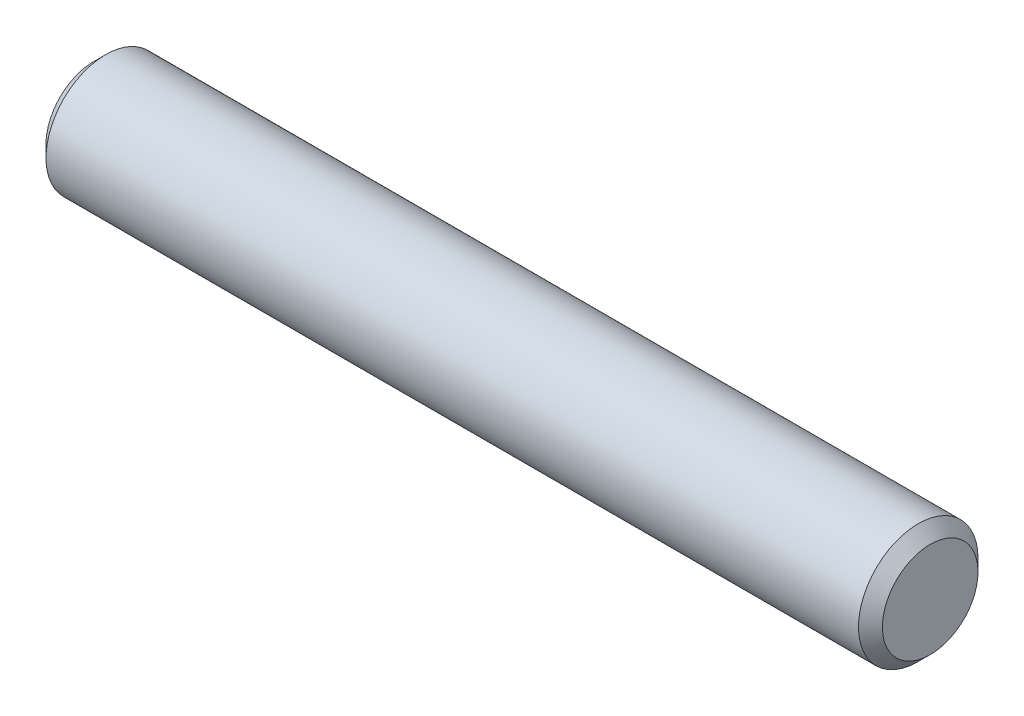
ISO-10303-21;
HEADER;
FILE_DESCRIPTION(('STEP AP214'),'2;1');
FILE_NAME('part.step','',(''),(''),'','','');
FILE_SCHEMA(('AUTOMOTIVE_DESIGN { 1 0 10303 214 1 1 1 1 }'));
ENDSEC;
DATA;
#1=APPLICATION_CONTEXT('core data for automotive mechanical design processes');
#2=APPLICATION_PROTOCOL_DEFINITION('international standard','automotive_design',2000,#1);
#3=PRODUCT_CONTEXT('',#1,'mechanical');
#4=PRODUCT('Part','Part','',(#3));
#5=PRODUCT_RELATED_PRODUCT_CATEGORY('part','',(#4));
#6=PRODUCT_DEFINITION_FORMATION('','',#4);
#7=PRODUCT_DEFINITION_CONTEXT('part definition',#1,'design');
#8=PRODUCT_DEFINITION('design','',#6,#7);
#9=PRODUCT_DEFINITION_SHAPE('','',#8);
#10=(LENGTH_UNIT() NAMED_UNIT(*) SI_UNIT(.MILLI.,.METRE.));
#11=(NAMED_UNIT(*) PLANE_ANGLE_UNIT() SI_UNIT($,.RADIAN.));
#12=(NAMED_UNIT(*) SI_UNIT($,.STERADIAN.) SOLID_ANGLE_UNIT());
#13=UNCERTAINTY_MEASURE_WITH_UNIT(LENGTH_MEASURE(1.E-05),#10,'distance_accuracy_value','');
#14=(GEOMETRIC_REPRESENTATION_CONTEXT(3) GLOBAL_UNCERTAINTY_ASSIGNED_CONTEXT((#13)) GLOBAL_UNIT_ASSIGNED_CONTEXT((#10,
#11,#12)) REPRESENTATION_CONTEXT('',''));
#15=CARTESIAN_POINT('',(0.,0.,0.));
#16=DIRECTION('',(0.,0.,1.));
#17=DIRECTION('',(1.,0.,0.));
#18=AXIS2_PLACEMENT_3D('',#15,#16,#17);
#19=CARTESIAN_POINT('',(-11.1125,0.,0.));
#20=DIRECTION('',(1.,0.,0.));
#21=DIRECTION('',(0.,0.,-1.));
#22=AXIS2_PLACEMENT_3D('',#19,#20,#21);
#23=CYLINDRICAL_SURFACE('',#22,1.5875);
#24=CARTESIAN_POINT('',(10.795,0.,0.));
#25=DIRECTION('',(1.,0.,0.));
#26=DIRECTION('',(0.,0.,-1.));
#27=AXIS2_PLACEMENT_3D('',#24,#25,#26);
#28=CIRCLE('',#27,1.5875);
#29=CARTESIAN_POINT('',(10.795,0.,-1.5875));
#30=VERTEX_POINT('',#29);
#31=EDGE_CURVE('E39',#30,#30,#28,.F.);
#32=ORIENTED_EDGE('',*,*,#31,.T.);
#33=EDGE_LOOP('',(#32));
#34=FACE_BOUND('',#33,.T.);
#35=CARTESIAN_POINT('',(-10.795,0.,0.));
#36=DIRECTION('',(1.,0.,0.));
#37=DIRECTION('',(0.,0.,-1.));
#38=AXIS2_PLACEMENT_3D('',#35,#36,#37);
#39=CIRCLE('',#38,1.5875);
#40=CARTESIAN_POINT('',(-10.795,0.,-1.5875));
#41=VERTEX_POINT('',#40);
#42=EDGE_CURVE('E43',#41,#41,#39,.T.);
#43=ORIENTED_EDGE('',*,*,#42,.T.);
#44=EDGE_LOOP('',(#43));
#45=FACE_BOUND('',#44,.T.);
#46=ADVANCED_FACE('F32',(#34,#45),#23,.T.);
#47=CARTESIAN_POINT('',(-11.1125,0.,0.));
#48=DIRECTION('',(1.,0.,0.));
#49=DIRECTION('',(0.,0.,-1.));
#50=AXIS2_PLACEMENT_3D('',#47,#48,#49);
#51=PLANE('',#50);
#52=CARTESIAN_POINT('',(-11.1125,0.,0.));
#53=DIRECTION('',(1.,0.,0.));
#54=DIRECTION('',(0.,0.,-1.));
#55=AXIS2_PLACEMENT_3D('',#52,#53,#54);
#56=CIRCLE('',#55,1.26999999999999);
#57=CARTESIAN_POINT('',(-11.1125,0.,-1.26999999999999));
#58=VERTEX_POINT('',#57);
#59=EDGE_CURVE('E10',#58,#58,#56,.F.);
#60=ORIENTED_EDGE('',*,*,#59,.T.);
#61=EDGE_LOOP('',(#60));
#62=FACE_BOUND('',#61,.T.);
#63=ADVANCED_FACE('F63',(#62),#51,.F.);
#64=CARTESIAN_POINT('',(11.1125,0.,0.));
#65=DIRECTION('',(1.,0.,0.));
#66=DIRECTION('',(0.,0.,-1.));
#67=AXIS2_PLACEMENT_3D('',#64,#65,#66);
#68=PLANE('',#67);
#69=CARTESIAN_POINT('',(11.1125,0.,0.));
#70=DIRECTION('',(1.,0.,0.));
#71=DIRECTION('',(0.,0.,-1.));
#72=AXIS2_PLACEMENT_3D('',#69,#70,#71);
#73=CIRCLE('',#72,1.27000000000001);
#74=CARTESIAN_POINT('',(11.1125,0.,-1.27000000000001));
#75=VERTEX_POINT('',#74);
#76=EDGE_CURVE('E47',#75,#75,#73,.T.);
#77=ORIENTED_EDGE('',*,*,#76,.T.);
#78=EDGE_LOOP('',(#77));
#79=FACE_BOUND('',#78,.T.);
#80=ADVANCED_FACE('F53',(#79),#68,.T.);
#81=CARTESIAN_POINT('',(11.1125,0.,0.));
#82=DIRECTION('',(-1.,0.,0.));
#83=DIRECTION('',(0.,0.,1.));
#84=AXIS2_PLACEMENT_3D('',#81,#82,#83);
#85=CONICAL_SURFACE('',#84,1.27,0.785398163397445);
#86=ORIENTED_EDGE('',*,*,#31,.F.);
#87=EDGE_LOOP('',(#86));
#88=FACE_BOUND('',#87,.T.);
#89=ORIENTED_EDGE('',*,*,#76,.F.);
#90=EDGE_LOOP('',(#89));
#91=FACE_BOUND('',#90,.T.);
#92=ADVANCED_FACE('F55',(#88,#91),#85,.T.);
#93=CARTESIAN_POINT('',(-10.795,0.,0.));
#94=DIRECTION('',(1.,0.,0.));
#95=DIRECTION('',(0.,0.,-1.));
#96=AXIS2_PLACEMENT_3D('',#93,#94,#95);
#97=CONICAL_SURFACE('',#96,1.5875,0.785398163397453);
#98=ORIENTED_EDGE('',*,*,#59,.F.);
#99=EDGE_LOOP('',(#98));
#100=FACE_BOUND('',#99,.T.);
#101=ORIENTED_EDGE('',*,*,#42,.F.);
#102=EDGE_LOOP('',(#101));
#103=FACE_BOUND('',#102,.T.);
#104=ADVANCED_FACE('F34',(#100,#103),#97,.T.);
#105=CLOSED_SHELL('',(#46,#63,#80,#92,#104));
#106=MANIFOLD_SOLID_BREP('B2',#105);
#107=ADVANCED_BREP_SHAPE_REPRESENTATION('',(#18,#106),#14);
#108=SHAPE_DEFINITION_REPRESENTATION(#9,#107);
ENDSEC;
END-ISO-10303-21;
